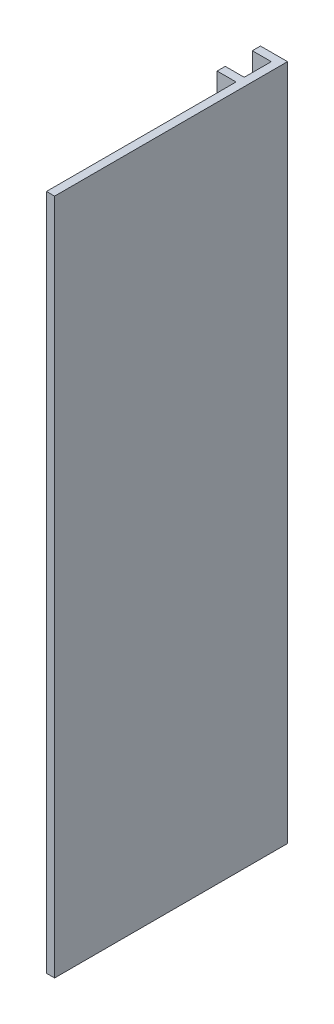
ISO-10303-21;
HEADER;
FILE_DESCRIPTION(('STEP AP214'),'2;1');
FILE_NAME('part.step','',(''),(''),'','','');
FILE_SCHEMA(('AUTOMOTIVE_DESIGN { 1 0 10303 214 1 1 1 1 }'));
ENDSEC;
DATA;
#1=APPLICATION_CONTEXT('core data for automotive mechanical design processes');
#2=APPLICATION_PROTOCOL_DEFINITION('international standard','automotive_design',2000,#1);
#3=PRODUCT_CONTEXT('',#1,'mechanical');
#4=PRODUCT('Part','Part','',(#3));
#5=PRODUCT_RELATED_PRODUCT_CATEGORY('part','',(#4));
#6=PRODUCT_DEFINITION_FORMATION('','',#4);
#7=PRODUCT_DEFINITION_CONTEXT('part definition',#1,'design');
#8=PRODUCT_DEFINITION('design','',#6,#7);
#9=PRODUCT_DEFINITION_SHAPE('','',#8);
#10=(LENGTH_UNIT() NAMED_UNIT(*) SI_UNIT(.MILLI.,.METRE.));
#11=(NAMED_UNIT(*) PLANE_ANGLE_UNIT() SI_UNIT($,.RADIAN.));
#12=(NAMED_UNIT(*) SI_UNIT($,.STERADIAN.) SOLID_ANGLE_UNIT());
#13=UNCERTAINTY_MEASURE_WITH_UNIT(LENGTH_MEASURE(1.E-05),#10,'distance_accuracy_value','');
#14=(GEOMETRIC_REPRESENTATION_CONTEXT(3) GLOBAL_UNCERTAINTY_ASSIGNED_CONTEXT((#13)) GLOBAL_UNIT_ASSIGNED_CONTEXT((#10,
#11,#12)) REPRESENTATION_CONTEXT('',''));
#15=CARTESIAN_POINT('',(0.,0.,0.));
#16=DIRECTION('',(0.,0.,1.));
#17=DIRECTION('',(1.,0.,0.));
#18=AXIS2_PLACEMENT_3D('',#15,#16,#17);
#19=CARTESIAN_POINT('',(-1.13333333333335,250.,-60.7608678024219));
#20=DIRECTION('',(1.,0.,0.));
#21=DIRECTION('',(0.,0.,-1.));
#22=AXIS2_PLACEMENT_3D('',#19,#20,#21);
#23=PLANE('',#22);
#24=DIRECTION('',(0.,0.,1.));
#25=VECTOR('',#24,1.);
#26=CARTESIAN_POINT('',(-1.13333333333335,0.,-60.7608678024219));
#27=LINE('',#26,#25);
#28=CARTESIAN_POINT('',(-1.13333333333335,0.,-63.7608678024219));
#29=VERTEX_POINT('',#28);
#30=CARTESIAN_POINT('',(-1.13333333333335,0.,-60.7608678024219));
#31=VERTEX_POINT('',#30);
#32=EDGE_CURVE('E152',#29,#31,#27,.T.);
#33=ORIENTED_EDGE('',*,*,#32,.T.);
#34=DIRECTION('',(0.,-1.,0.));
#35=VECTOR('',#34,1.);
#36=CARTESIAN_POINT('',(-1.13333333333335,250.,-60.7608678024219));
#37=LINE('',#36,#35);
#38=CARTESIAN_POINT('',(-1.13333333333335,250.,-60.7608678024219));
#39=VERTEX_POINT('',#38);
#40=EDGE_CURVE('E11',#39,#31,#37,.T.);
#41=ORIENTED_EDGE('',*,*,#40,.F.);
#42=DIRECTION('',(0.,0.,1.));
#43=VECTOR('',#42,1.);
#44=CARTESIAN_POINT('',(-1.13333333333335,250.,-60.7608678024219));
#45=LINE('',#44,#43);
#46=CARTESIAN_POINT('',(-1.13333333333335,250.,-63.7608678024219));
#47=VERTEX_POINT('',#46);
#48=EDGE_CURVE('E180',#47,#39,#45,.T.);
#49=ORIENTED_EDGE('',*,*,#48,.F.);
#50=DIRECTION('',(0.,-1.,0.));
#51=VECTOR('',#50,1.);
#52=CARTESIAN_POINT('',(-1.13333333333335,250.,-63.7608678024219));
#53=LINE('',#52,#51);
#54=EDGE_CURVE('E148',#47,#29,#53,.T.);
#55=ORIENTED_EDGE('',*,*,#54,.T.);
#56=EDGE_LOOP('',(#33,#41,#49,#55));
#57=FACE_BOUND('',#56,.T.);
#58=ADVANCED_FACE('F39',(#57),#23,.F.);
#59=CARTESIAN_POINT('',(5.86666666666665,250.,-60.7608678024219));
#60=DIRECTION('',(0.,0.,-1.));
#61=DIRECTION('',(-1.,0.,0.));
#62=AXIS2_PLACEMENT_3D('',#59,#60,#61);
#63=PLANE('',#62);
#64=DIRECTION('',(1.,0.,0.));
#65=VECTOR('',#64,1.);
#66=CARTESIAN_POINT('',(5.86666666666665,0.,-60.7608678024219));
#67=LINE('',#66,#65);
#68=CARTESIAN_POINT('',(5.86666666666665,0.,-60.7608678024219));
#69=VERTEX_POINT('',#68);
#70=EDGE_CURVE('E156',#31,#69,#67,.T.);
#71=ORIENTED_EDGE('',*,*,#70,.T.);
#72=DIRECTION('',(0.,-1.,0.));
#73=VECTOR('',#72,1.);
#74=CARTESIAN_POINT('',(5.86666666666665,250.,-60.7608678024219));
#75=LINE('',#74,#73);
#76=CARTESIAN_POINT('',(5.86666666666665,250.,-60.7608678024219));
#77=VERTEX_POINT('',#76);
#78=EDGE_CURVE('E48',#77,#69,#75,.T.);
#79=ORIENTED_EDGE('',*,*,#78,.F.);
#80=DIRECTION('',(1.,0.,0.));
#81=VECTOR('',#80,1.);
#82=CARTESIAN_POINT('',(5.86666666666665,250.,-60.7608678024219));
#83=LINE('',#82,#81);
#84=EDGE_CURVE('E105',#39,#77,#83,.T.);
#85=ORIENTED_EDGE('',*,*,#84,.F.);
#86=ORIENTED_EDGE('',*,*,#40,.T.);
#87=EDGE_LOOP('',(#71,#79,#85,#86));
#88=FACE_BOUND('',#87,.T.);
#89=ADVANCED_FACE('F244',(#88),#63,.F.);
#90=CARTESIAN_POINT('',(5.86666666666665,250.,-50.7608678024219));
#91=DIRECTION('',(1.,0.,0.));
#92=DIRECTION('',(0.,0.,-1.));
#93=AXIS2_PLACEMENT_3D('',#90,#91,#92);
#94=PLANE('',#93);
#95=DIRECTION('',(0.,0.,1.));
#96=VECTOR('',#95,1.);
#97=CARTESIAN_POINT('',(5.86666666666665,0.,-50.7608678024219));
#98=LINE('',#97,#96);
#99=CARTESIAN_POINT('',(5.86666666666665,0.,-50.7608678024219));
#100=VERTEX_POINT('',#99);
#101=EDGE_CURVE('E159',#69,#100,#98,.T.);
#102=ORIENTED_EDGE('',*,*,#101,.T.);
#103=DIRECTION('',(0.,-1.,0.));
#104=VECTOR('',#103,1.);
#105=CARTESIAN_POINT('',(5.86666666666665,250.,-50.7608678024219));
#106=LINE('',#105,#104);
#107=CARTESIAN_POINT('',(5.86666666666665,250.,-50.7608678024219));
#108=VERTEX_POINT('',#107);
#109=EDGE_CURVE('E199',#108,#100,#106,.T.);
#110=ORIENTED_EDGE('',*,*,#109,.F.);
#111=DIRECTION('',(0.,0.,1.));
#112=VECTOR('',#111,1.);
#113=CARTESIAN_POINT('',(5.86666666666665,250.,-50.7608678024219));
#114=LINE('',#113,#112);
#115=EDGE_CURVE('E209',#77,#108,#114,.T.);
#116=ORIENTED_EDGE('',*,*,#115,.F.);
#117=ORIENTED_EDGE('',*,*,#78,.T.);
#118=EDGE_LOOP('',(#102,#110,#116,#117));
#119=FACE_BOUND('',#118,.T.);
#120=ADVANCED_FACE('F207',(#119),#94,.F.);
#121=CARTESIAN_POINT('',(-1.13333333333334,250.,-50.7608678024219));
#122=DIRECTION('',(0.,0.,1.));
#123=DIRECTION('',(1.,0.,0.));
#124=AXIS2_PLACEMENT_3D('',#121,#122,#123);
#125=PLANE('',#124);
#126=DIRECTION('',(-1.,0.,0.));
#127=VECTOR('',#126,1.);
#128=CARTESIAN_POINT('',(-1.13333333333334,0.,-50.7608678024219));
#129=LINE('',#128,#127);
#130=CARTESIAN_POINT('',(-1.13333333333334,0.,-50.7608678024219));
#131=VERTEX_POINT('',#130);
#132=EDGE_CURVE('E162',#100,#131,#129,.T.);
#133=ORIENTED_EDGE('',*,*,#132,.T.);
#134=DIRECTION('',(0.,-1.,0.));
#135=VECTOR('',#134,1.);
#136=CARTESIAN_POINT('',(-1.13333333333334,250.,-50.7608678024219));
#137=LINE('',#136,#135);
#138=CARTESIAN_POINT('',(-1.13333333333334,250.,-50.7608678024219));
#139=VERTEX_POINT('',#138);
#140=EDGE_CURVE('E195',#139,#131,#137,.T.);
#141=ORIENTED_EDGE('',*,*,#140,.F.);
#142=DIRECTION('',(-1.,0.,0.));
#143=VECTOR('',#142,1.);
#144=CARTESIAN_POINT('',(-1.13333333333334,250.,-50.7608678024219));
#145=LINE('',#144,#143);
#146=EDGE_CURVE('E228',#108,#139,#145,.T.);
#147=ORIENTED_EDGE('',*,*,#146,.F.);
#148=ORIENTED_EDGE('',*,*,#109,.T.);
#149=EDGE_LOOP('',(#133,#141,#147,#148));
#150=FACE_BOUND('',#149,.T.);
#151=ADVANCED_FACE('F218',(#150),#125,.F.);
#152=CARTESIAN_POINT('',(-1.13333333333334,250.,-47.7608678024219));
#153=DIRECTION('',(1.,0.,0.));
#154=DIRECTION('',(0.,0.,-1.));
#155=AXIS2_PLACEMENT_3D('',#152,#153,#154);
#156=PLANE('',#155);
#157=DIRECTION('',(0.,0.,1.));
#158=VECTOR('',#157,1.);
#159=CARTESIAN_POINT('',(-1.13333333333334,0.,-47.7608678024219));
#160=LINE('',#159,#158);
#161=CARTESIAN_POINT('',(-1.13333333333334,0.,-47.7608678024219));
#162=VERTEX_POINT('',#161);
#163=EDGE_CURVE('E165',#131,#162,#160,.T.);
#164=ORIENTED_EDGE('',*,*,#163,.T.);
#165=DIRECTION('',(0.,-1.,0.));
#166=VECTOR('',#165,1.);
#167=CARTESIAN_POINT('',(-1.13333333333334,250.,-47.7608678024219));
#168=LINE('',#167,#166);
#169=CARTESIAN_POINT('',(-1.13333333333334,250.,-47.7608678024219));
#170=VERTEX_POINT('',#169);
#171=EDGE_CURVE('E191',#170,#162,#168,.T.);
#172=ORIENTED_EDGE('',*,*,#171,.F.);
#173=DIRECTION('',(0.,0.,1.));
#174=VECTOR('',#173,1.);
#175=CARTESIAN_POINT('',(-1.13333333333334,250.,-47.7608678024219));
#176=LINE('',#175,#174);
#177=EDGE_CURVE('E224',#139,#170,#176,.T.);
#178=ORIENTED_EDGE('',*,*,#177,.F.);
#179=ORIENTED_EDGE('',*,*,#140,.T.);
#180=EDGE_LOOP('',(#164,#172,#178,#179));
#181=FACE_BOUND('',#180,.T.);
#182=ADVANCED_FACE('F222',(#181),#156,.F.);
#183=CARTESIAN_POINT('',(5.86666666666666,250.,-47.7608678024219));
#184=DIRECTION('',(0.,0.,-1.));
#185=DIRECTION('',(-1.,0.,0.));
#186=AXIS2_PLACEMENT_3D('',#183,#184,#185);
#187=PLANE('',#186);
#188=DIRECTION('',(1.,0.,0.));
#189=VECTOR('',#188,1.);
#190=CARTESIAN_POINT('',(5.86666666666666,0.,-47.7608678024219));
#191=LINE('',#190,#189);
#192=CARTESIAN_POINT('',(5.86666666666666,0.,-47.7608678024219));
#193=VERTEX_POINT('',#192);
#194=EDGE_CURVE('E168',#162,#193,#191,.T.);
#195=ORIENTED_EDGE('',*,*,#194,.T.);
#196=DIRECTION('',(0.,-1.,0.));
#197=VECTOR('',#196,1.);
#198=CARTESIAN_POINT('',(5.86666666666666,250.,-47.7608678024219));
#199=LINE('',#198,#197);
#200=CARTESIAN_POINT('',(5.86666666666666,250.,-47.7608678024219));
#201=VERTEX_POINT('',#200);
#202=EDGE_CURVE('E187',#201,#193,#199,.T.);
#203=ORIENTED_EDGE('',*,*,#202,.F.);
#204=DIRECTION('',(1.,0.,0.));
#205=VECTOR('',#204,1.);
#206=CARTESIAN_POINT('',(5.86666666666666,250.,-47.7608678024219));
#207=LINE('',#206,#205);
#208=EDGE_CURVE('E227',#170,#201,#207,.T.);
#209=ORIENTED_EDGE('',*,*,#208,.F.);
#210=ORIENTED_EDGE('',*,*,#171,.T.);
#211=EDGE_LOOP('',(#195,#203,#209,#210));
#212=FACE_BOUND('',#211,.T.);
#213=ADVANCED_FACE('F256',(#212),#187,.F.);
#214=CARTESIAN_POINT('',(5.86666666666666,250.,22.2391321975781));
#215=DIRECTION('',(1.,0.,0.));
#216=DIRECTION('',(0.,0.,-1.));
#217=AXIS2_PLACEMENT_3D('',#214,#215,#216);
#218=PLANE('',#217);
#219=DIRECTION('',(0.,0.,1.));
#220=VECTOR('',#219,1.);
#221=CARTESIAN_POINT('',(5.86666666666666,0.,22.2391321975781));
#222=LINE('',#221,#220);
#223=CARTESIAN_POINT('',(5.86666666666666,0.,22.2391321975781));
#224=VERTEX_POINT('',#223);
#225=EDGE_CURVE('E171',#193,#224,#222,.T.);
#226=ORIENTED_EDGE('',*,*,#225,.T.);
#227=DIRECTION('',(0.,-1.,0.));
#228=VECTOR('',#227,1.);
#229=CARTESIAN_POINT('',(5.86666666666666,250.,22.2391321975781));
#230=LINE('',#229,#228);
#231=CARTESIAN_POINT('',(5.86666666666666,250.,22.2391321975781));
#232=VERTEX_POINT('',#231);
#233=EDGE_CURVE('E141',#232,#224,#230,.T.);
#234=ORIENTED_EDGE('',*,*,#233,.F.);
#235=DIRECTION('',(0.,0.,1.));
#236=VECTOR('',#235,1.);
#237=CARTESIAN_POINT('',(5.86666666666666,250.,22.2391321975781));
#238=LINE('',#237,#236);
#239=EDGE_CURVE('E130',#201,#232,#238,.T.);
#240=ORIENTED_EDGE('',*,*,#239,.F.);
#241=ORIENTED_EDGE('',*,*,#202,.T.);
#242=EDGE_LOOP('',(#226,#234,#240,#241));
#243=FACE_BOUND('',#242,.T.);
#244=ADVANCED_FACE('F259',(#243),#218,.F.);
#245=CARTESIAN_POINT('',(8.86666666666666,250.,22.2391321975781));
#246=DIRECTION('',(0.,0.,-1.));
#247=DIRECTION('',(-1.,0.,0.));
#248=AXIS2_PLACEMENT_3D('',#245,#246,#247);
#249=PLANE('',#248);
#250=DIRECTION('',(1.,0.,0.));
#251=VECTOR('',#250,1.);
#252=CARTESIAN_POINT('',(8.86666666666666,0.,22.2391321975781));
#253=LINE('',#252,#251);
#254=CARTESIAN_POINT('',(8.86666666666666,0.,22.2391321975781));
#255=VERTEX_POINT('',#254);
#256=EDGE_CURVE('E139',#224,#255,#253,.T.);
#257=ORIENTED_EDGE('',*,*,#256,.T.);
#258=DIRECTION('',(0.,-1.,0.));
#259=VECTOR('',#258,1.);
#260=CARTESIAN_POINT('',(8.86666666666666,250.,22.2391321975781));
#261=LINE('',#260,#259);
#262=CARTESIAN_POINT('',(8.86666666666666,250.,22.2391321975781));
#263=VERTEX_POINT('',#262);
#264=EDGE_CURVE('E136',#263,#255,#261,.T.);
#265=ORIENTED_EDGE('',*,*,#264,.F.);
#266=DIRECTION('',(1.,0.,0.));
#267=VECTOR('',#266,1.);
#268=CARTESIAN_POINT('',(8.86666666666666,250.,22.2391321975781));
#269=LINE('',#268,#267);
#270=EDGE_CURVE('E124',#232,#263,#269,.T.);
#271=ORIENTED_EDGE('',*,*,#270,.F.);
#272=ORIENTED_EDGE('',*,*,#233,.T.);
#273=EDGE_LOOP('',(#257,#265,#271,#272));
#274=FACE_BOUND('',#273,.T.);
#275=ADVANCED_FACE('F137',(#274),#249,.F.);
#276=CARTESIAN_POINT('',(8.86666666666665,250.,-63.7608678024219));
#277=DIRECTION('',(-1.,0.,0.));
#278=DIRECTION('',(0.,0.,1.));
#279=AXIS2_PLACEMENT_3D('',#276,#277,#278);
#280=PLANE('',#279);
#281=DIRECTION('',(0.,0.,-1.));
#282=VECTOR('',#281,1.);
#283=CARTESIAN_POINT('',(8.86666666666665,0.,-63.7608678024219));
#284=LINE('',#283,#282);
#285=CARTESIAN_POINT('',(8.86666666666665,0.,-63.7608678024219));
#286=VERTEX_POINT('',#285);
#287=EDGE_CURVE('E91',#255,#286,#284,.T.);
#288=ORIENTED_EDGE('',*,*,#287,.T.);
#289=DIRECTION('',(0.,-1.,0.));
#290=VECTOR('',#289,1.);
#291=CARTESIAN_POINT('',(8.86666666666665,250.,-63.7608678024219));
#292=LINE('',#291,#290);
#293=CARTESIAN_POINT('',(8.86666666666665,250.,-63.7608678024219));
#294=VERTEX_POINT('',#293);
#295=EDGE_CURVE('E142',#294,#286,#292,.T.);
#296=ORIENTED_EDGE('',*,*,#295,.F.);
#297=DIRECTION('',(0.,0.,-1.));
#298=VECTOR('',#297,1.);
#299=CARTESIAN_POINT('',(8.86666666666665,250.,-63.7608678024219));
#300=LINE('',#299,#298);
#301=EDGE_CURVE('E128',#263,#294,#300,.T.);
#302=ORIENTED_EDGE('',*,*,#301,.F.);
#303=ORIENTED_EDGE('',*,*,#264,.T.);
#304=EDGE_LOOP('',(#288,#296,#302,#303));
#305=FACE_BOUND('',#304,.T.);
#306=ADVANCED_FACE('F144',(#305),#280,.F.);
#307=CARTESIAN_POINT('',(-1.13333333333335,250.,-63.7608678024219));
#308=DIRECTION('',(0.,0.,1.));
#309=DIRECTION('',(1.,0.,0.));
#310=AXIS2_PLACEMENT_3D('',#307,#308,#309);
#311=PLANE('',#310);
#312=DIRECTION('',(-1.,0.,0.));
#313=VECTOR('',#312,1.);
#314=CARTESIAN_POINT('',(-1.13333333333335,0.,-63.7608678024219));
#315=LINE('',#314,#313);
#316=EDGE_CURVE('E97',#286,#29,#315,.T.);
#317=ORIENTED_EDGE('',*,*,#316,.T.);
#318=ORIENTED_EDGE('',*,*,#54,.F.);
#319=DIRECTION('',(-1.,0.,0.));
#320=VECTOR('',#319,1.);
#321=CARTESIAN_POINT('',(-1.13333333333335,250.,-63.7608678024219));
#322=LINE('',#321,#320);
#323=EDGE_CURVE('E56',#294,#47,#322,.T.);
#324=ORIENTED_EDGE('',*,*,#323,.F.);
#325=ORIENTED_EDGE('',*,*,#295,.T.);
#326=EDGE_LOOP('',(#317,#318,#324,#325));
#327=FACE_BOUND('',#326,.T.);
#328=ADVANCED_FACE('F268',(#327),#311,.F.);
#329=CARTESIAN_POINT('',(0.,250.,0.));
#330=DIRECTION('',(0.,-1.,0.));
#331=DIRECTION('',(0.,0.,-1.));
#332=AXIS2_PLACEMENT_3D('',#329,#330,#331);
#333=PLANE('',#332);
#334=ORIENTED_EDGE('',*,*,#48,.T.);
#335=ORIENTED_EDGE('',*,*,#84,.T.);
#336=ORIENTED_EDGE('',*,*,#115,.T.);
#337=ORIENTED_EDGE('',*,*,#146,.T.);
#338=ORIENTED_EDGE('',*,*,#177,.T.);
#339=ORIENTED_EDGE('',*,*,#208,.T.);
#340=ORIENTED_EDGE('',*,*,#239,.T.);
#341=ORIENTED_EDGE('',*,*,#270,.T.);
#342=ORIENTED_EDGE('',*,*,#301,.T.);
#343=ORIENTED_EDGE('',*,*,#323,.T.);
#344=EDGE_LOOP('',(#334,#335,#336,#337,#338,#339,#340,#341,#342,#343));
#345=FACE_BOUND('',#344,.T.);
#346=ADVANCED_FACE('F126',(#345),#333,.F.);
#347=CARTESIAN_POINT('',(0.,0.,0.));
#348=DIRECTION('',(0.,-1.,0.));
#349=DIRECTION('',(0.,0.,-1.));
#350=AXIS2_PLACEMENT_3D('',#347,#348,#349);
#351=PLANE('',#350);
#352=ORIENTED_EDGE('',*,*,#32,.F.);
#353=ORIENTED_EDGE('',*,*,#316,.F.);
#354=ORIENTED_EDGE('',*,*,#287,.F.);
#355=ORIENTED_EDGE('',*,*,#256,.F.);
#356=ORIENTED_EDGE('',*,*,#225,.F.);
#357=ORIENTED_EDGE('',*,*,#194,.F.);
#358=ORIENTED_EDGE('',*,*,#163,.F.);
#359=ORIENTED_EDGE('',*,*,#132,.F.);
#360=ORIENTED_EDGE('',*,*,#101,.F.);
#361=ORIENTED_EDGE('',*,*,#70,.F.);
#362=EDGE_LOOP('',(#352,#353,#354,#355,#356,#357,#358,#359,#360,#361));
#363=FACE_BOUND('',#362,.T.);
#364=ADVANCED_FACE('F213',(#363),#351,.T.);
#365=CLOSED_SHELL('',(#58,#89,#120,#151,#182,#213,#244,#275,#306,#328,#346,#364));
#366=MANIFOLD_SOLID_BREP('B2',#365);
#367=ADVANCED_BREP_SHAPE_REPRESENTATION('',(#18,#366),#14);
#368=SHAPE_DEFINITION_REPRESENTATION(#9,#367);
ENDSEC;
END-ISO-10303-21;
